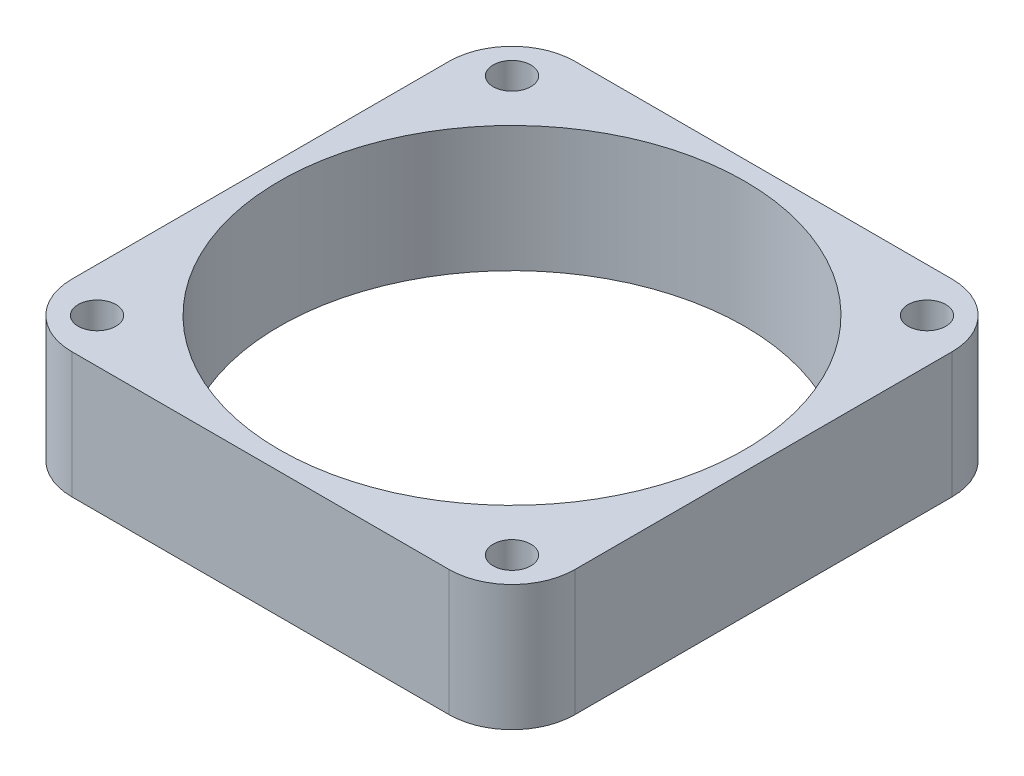
ISO-10303-21;
HEADER;
FILE_DESCRIPTION(('STEP AP214'),'2;1');
FILE_NAME('part.step','',(''),(''),'','','');
FILE_SCHEMA(('AUTOMOTIVE_DESIGN { 1 0 10303 214 1 1 1 1 }'));
ENDSEC;
DATA;
#1=APPLICATION_CONTEXT('core data for automotive mechanical design processes');
#2=APPLICATION_PROTOCOL_DEFINITION('international standard','automotive_design',2000,#1);
#3=PRODUCT_CONTEXT('',#1,'mechanical');
#4=PRODUCT('Part','Part','',(#3));
#5=PRODUCT_RELATED_PRODUCT_CATEGORY('part','',(#4));
#6=PRODUCT_DEFINITION_FORMATION('','',#4);
#7=PRODUCT_DEFINITION_CONTEXT('part definition',#1,'design');
#8=PRODUCT_DEFINITION('design','',#6,#7);
#9=PRODUCT_DEFINITION_SHAPE('','',#8);
#10=(LENGTH_UNIT() NAMED_UNIT(*) SI_UNIT(.MILLI.,.METRE.));
#11=(NAMED_UNIT(*) PLANE_ANGLE_UNIT() SI_UNIT($,.RADIAN.));
#12=(NAMED_UNIT(*) SI_UNIT($,.STERADIAN.) SOLID_ANGLE_UNIT());
#13=UNCERTAINTY_MEASURE_WITH_UNIT(LENGTH_MEASURE(1.E-05),#10,'distance_accuracy_value','');
#14=(GEOMETRIC_REPRESENTATION_CONTEXT(3) GLOBAL_UNCERTAINTY_ASSIGNED_CONTEXT((#13)) GLOBAL_UNIT_ASSIGNED_CONTEXT((#10,
#11,#12)) REPRESENTATION_CONTEXT('',''));
#15=CARTESIAN_POINT('',(0.,0.,0.));
#16=DIRECTION('',(0.,0.,1.));
#17=DIRECTION('',(1.,0.,0.));
#18=AXIS2_PLACEMENT_3D('',#15,#16,#17);
#19=CARTESIAN_POINT('',(20.,10.,20.));
#20=DIRECTION('',(-1.,0.,0.));
#21=DIRECTION('',(0.,0.,1.));
#22=AXIS2_PLACEMENT_3D('',#19,#20,#21);
#23=PLANE('',#22);
#24=DIRECTION('',(0.,0.,-1.));
#25=VECTOR('',#24,1.);
#26=CARTESIAN_POINT('',(20.,0.,20.));
#27=LINE('',#26,#25);
#28=CARTESIAN_POINT('',(20.,0.,15.));
#29=VERTEX_POINT('',#28);
#30=CARTESIAN_POINT('',(20.,0.,-15.));
#31=VERTEX_POINT('',#30);
#32=EDGE_CURVE('E130',#29,#31,#27,.T.);
#33=ORIENTED_EDGE('',*,*,#32,.T.);
#34=DIRECTION('',(0.,-1.,0.));
#35=VECTOR('',#34,1.);
#36=CARTESIAN_POINT('',(20.,10.,-15.));
#37=LINE('',#36,#35);
#38=CARTESIAN_POINT('',(20.,10.,-15.));
#39=VERTEX_POINT('',#38);
#40=EDGE_CURVE('E152',#31,#39,#37,.F.);
#41=ORIENTED_EDGE('',*,*,#40,.T.);
#42=DIRECTION('',(0.,0.,-1.));
#43=VECTOR('',#42,1.);
#44=CARTESIAN_POINT('',(20.,10.,20.));
#45=LINE('',#44,#43);
#46=CARTESIAN_POINT('',(20.,10.,15.));
#47=VERTEX_POINT('',#46);
#48=EDGE_CURVE('E128',#47,#39,#45,.T.);
#49=ORIENTED_EDGE('',*,*,#48,.F.);
#50=DIRECTION('',(0.,-1.,0.));
#51=VECTOR('',#50,1.);
#52=CARTESIAN_POINT('',(20.,10.,15.));
#53=LINE('',#52,#51);
#54=EDGE_CURVE('E149',#47,#29,#53,.T.);
#55=ORIENTED_EDGE('',*,*,#54,.T.);
#56=EDGE_LOOP('',(#33,#41,#49,#55));
#57=FACE_BOUND('',#56,.T.);
#58=ADVANCED_FACE('F33',(#57),#23,.F.);
#59=CARTESIAN_POINT('',(-20.,10.,-20.));
#60=DIRECTION('',(0.,0.,1.));
#61=DIRECTION('',(1.,0.,0.));
#62=AXIS2_PLACEMENT_3D('',#59,#60,#61);
#63=PLANE('',#62);
#64=DIRECTION('',(-1.,0.,0.));
#65=VECTOR('',#64,1.);
#66=CARTESIAN_POINT('',(-20.,0.,-20.));
#67=LINE('',#66,#65);
#68=CARTESIAN_POINT('',(15.,0.,-20.));
#69=VERTEX_POINT('',#68);
#70=CARTESIAN_POINT('',(-15.,0.,-20.));
#71=VERTEX_POINT('',#70);
#72=EDGE_CURVE('E126',#69,#71,#67,.T.);
#73=ORIENTED_EDGE('',*,*,#72,.T.);
#74=DIRECTION('',(0.,-1.,0.));
#75=VECTOR('',#74,1.);
#76=CARTESIAN_POINT('',(-15.,10.,-20.));
#77=LINE('',#76,#75);
#78=CARTESIAN_POINT('',(-15.,10.,-20.));
#79=VERTEX_POINT('',#78);
#80=EDGE_CURVE('E104',#71,#79,#77,.F.);
#81=ORIENTED_EDGE('',*,*,#80,.T.);
#82=DIRECTION('',(-1.,0.,0.));
#83=VECTOR('',#82,1.);
#84=CARTESIAN_POINT('',(-20.,10.,-20.));
#85=LINE('',#84,#83);
#86=CARTESIAN_POINT('',(15.,10.,-20.));
#87=VERTEX_POINT('',#86);
#88=EDGE_CURVE('E166',#87,#79,#85,.T.);
#89=ORIENTED_EDGE('',*,*,#88,.F.);
#90=DIRECTION('',(0.,-1.,0.));
#91=VECTOR('',#90,1.);
#92=CARTESIAN_POINT('',(15.,10.,-20.));
#93=LINE('',#92,#91);
#94=EDGE_CURVE('E109',#87,#69,#93,.T.);
#95=ORIENTED_EDGE('',*,*,#94,.T.);
#96=EDGE_LOOP('',(#73,#81,#89,#95));
#97=FACE_BOUND('',#96,.T.);
#98=ADVANCED_FACE('F171',(#97),#63,.F.);
#99=CARTESIAN_POINT('',(-20.,10.,20.));
#100=DIRECTION('',(1.,0.,0.));
#101=DIRECTION('',(0.,0.,-1.));
#102=AXIS2_PLACEMENT_3D('',#99,#100,#101);
#103=PLANE('',#102);
#104=DIRECTION('',(0.,0.,1.));
#105=VECTOR('',#104,1.);
#106=CARTESIAN_POINT('',(-20.,10.,20.));
#107=LINE('',#106,#105);
#108=CARTESIAN_POINT('',(-20.,10.,-15.));
#109=VERTEX_POINT('',#108);
#110=CARTESIAN_POINT('',(-20.,10.,15.));
#111=VERTEX_POINT('',#110);
#112=EDGE_CURVE('E118',#109,#111,#107,.T.);
#113=ORIENTED_EDGE('',*,*,#112,.F.);
#114=DIRECTION('',(0.,-1.,0.));
#115=VECTOR('',#114,1.);
#116=CARTESIAN_POINT('',(-20.,10.,-15.));
#117=LINE('',#116,#115);
#118=CARTESIAN_POINT('',(-20.,0.,-15.));
#119=VERTEX_POINT('',#118);
#120=EDGE_CURVE('E103',#109,#119,#117,.T.);
#121=ORIENTED_EDGE('',*,*,#120,.T.);
#122=DIRECTION('',(0.,0.,1.));
#123=VECTOR('',#122,1.);
#124=CARTESIAN_POINT('',(-20.,0.,20.));
#125=LINE('',#124,#123);
#126=CARTESIAN_POINT('',(-20.,0.,15.));
#127=VERTEX_POINT('',#126);
#128=EDGE_CURVE('E116',#119,#127,#125,.T.);
#129=ORIENTED_EDGE('',*,*,#128,.T.);
#130=DIRECTION('',(0.,-1.,0.));
#131=VECTOR('',#130,1.);
#132=CARTESIAN_POINT('',(-20.,10.,15.));
#133=LINE('',#132,#131);
#134=EDGE_CURVE('E120',#127,#111,#133,.F.);
#135=ORIENTED_EDGE('',*,*,#134,.T.);
#136=EDGE_LOOP('',(#113,#121,#129,#135));
#137=FACE_BOUND('',#136,.T.);
#138=ADVANCED_FACE('F115',(#137),#103,.F.);
#139=CARTESIAN_POINT('',(-20.,10.,20.));
#140=DIRECTION('',(0.,0.,-1.));
#141=DIRECTION('',(-1.,0.,0.));
#142=AXIS2_PLACEMENT_3D('',#139,#140,#141);
#143=PLANE('',#142);
#144=DIRECTION('',(1.,0.,0.));
#145=VECTOR('',#144,1.);
#146=CARTESIAN_POINT('',(-20.,10.,20.));
#147=LINE('',#146,#145);
#148=CARTESIAN_POINT('',(-15.,10.,20.));
#149=VERTEX_POINT('',#148);
#150=CARTESIAN_POINT('',(15.,10.,20.));
#151=VERTEX_POINT('',#150);
#152=EDGE_CURVE('E134',#149,#151,#147,.T.);
#153=ORIENTED_EDGE('',*,*,#152,.F.);
#154=DIRECTION('',(0.,-1.,0.));
#155=VECTOR('',#154,1.);
#156=CARTESIAN_POINT('',(-15.,10.,20.));
#157=LINE('',#156,#155);
#158=CARTESIAN_POINT('',(-15.,0.,20.));
#159=VERTEX_POINT('',#158);
#160=EDGE_CURVE('E11',#149,#159,#157,.T.);
#161=ORIENTED_EDGE('',*,*,#160,.T.);
#162=DIRECTION('',(1.,0.,0.));
#163=VECTOR('',#162,1.);
#164=CARTESIAN_POINT('',(-20.,0.,20.));
#165=LINE('',#164,#163);
#166=CARTESIAN_POINT('',(15.,0.,20.));
#167=VERTEX_POINT('',#166);
#168=EDGE_CURVE('E125',#159,#167,#165,.T.);
#169=ORIENTED_EDGE('',*,*,#168,.T.);
#170=DIRECTION('',(0.,-1.,0.));
#171=VECTOR('',#170,1.);
#172=CARTESIAN_POINT('',(15.,10.,20.));
#173=LINE('',#172,#171);
#174=EDGE_CURVE('E41',#167,#151,#173,.F.);
#175=ORIENTED_EDGE('',*,*,#174,.T.);
#176=EDGE_LOOP('',(#153,#161,#169,#175));
#177=FACE_BOUND('',#176,.T.);
#178=ADVANCED_FACE('F218',(#177),#143,.F.);
#179=CARTESIAN_POINT('',(20.,10.,-20.));
#180=DIRECTION('',(0.,-1.,0.));
#181=DIRECTION('',(0.,0.,-1.));
#182=AXIS2_PLACEMENT_3D('',#179,#180,#181);
#183=PLANE('',#182);
#184=CARTESIAN_POINT('',(-16.5,10.,16.5));
#185=DIRECTION('',(0.,1.,0.));
#186=DIRECTION('',(0.,0.,-1.));
#187=AXIS2_PLACEMENT_3D('',#184,#185,#186);
#188=CIRCLE('',#187,1.5);
#189=CARTESIAN_POINT('',(-16.5,10.,15.));
#190=VERTEX_POINT('',#189);
#191=EDGE_CURVE('E201',#190,#190,#188,.T.);
#192=ORIENTED_EDGE('',*,*,#191,.F.);
#193=EDGE_LOOP('',(#192));
#194=FACE_BOUND('',#193,.T.);
#195=CARTESIAN_POINT('',(16.5,10.,16.5));
#196=DIRECTION('',(0.,1.,0.));
#197=DIRECTION('',(0.,0.,1.));
#198=AXIS2_PLACEMENT_3D('',#195,#196,#197);
#199=CIRCLE('',#198,1.5);
#200=CARTESIAN_POINT('',(16.5,10.,18.));
#201=VERTEX_POINT('',#200);
#202=EDGE_CURVE('E195',#201,#201,#199,.T.);
#203=ORIENTED_EDGE('',*,*,#202,.F.);
#204=EDGE_LOOP('',(#203));
#205=FACE_BOUND('',#204,.T.);
#206=CARTESIAN_POINT('',(16.5,10.,-16.5));
#207=DIRECTION('',(0.,1.,0.));
#208=DIRECTION('',(0.,0.,-1.));
#209=AXIS2_PLACEMENT_3D('',#206,#207,#208);
#210=CIRCLE('',#209,1.5);
#211=CARTESIAN_POINT('',(16.5,10.,-18.));
#212=VERTEX_POINT('',#211);
#213=EDGE_CURVE('E189',#212,#212,#210,.T.);
#214=ORIENTED_EDGE('',*,*,#213,.F.);
#215=EDGE_LOOP('',(#214));
#216=FACE_BOUND('',#215,.T.);
#217=CARTESIAN_POINT('',(-16.5,10.,-16.5));
#218=DIRECTION('',(0.,1.,0.));
#219=DIRECTION('',(0.,0.,1.));
#220=AXIS2_PLACEMENT_3D('',#217,#218,#219);
#221=CIRCLE('',#220,1.5);
#222=CARTESIAN_POINT('',(-16.5,10.,-15.));
#223=VERTEX_POINT('',#222);
#224=EDGE_CURVE('E183',#223,#223,#221,.T.);
#225=ORIENTED_EDGE('',*,*,#224,.F.);
#226=EDGE_LOOP('',(#225));
#227=FACE_BOUND('',#226,.T.);
#228=CARTESIAN_POINT('',(0.,10.,0.));
#229=DIRECTION('',(0.,1.,0.));
#230=DIRECTION('',(0.,0.,1.));
#231=AXIS2_PLACEMENT_3D('',#228,#229,#230);
#232=CIRCLE('',#231,18.5);
#233=CARTESIAN_POINT('',(0.,10.,18.5));
#234=VERTEX_POINT('',#233);
#235=EDGE_CURVE('E174',#234,#234,#232,.T.);
#236=ORIENTED_EDGE('',*,*,#235,.F.);
#237=EDGE_LOOP('',(#236));
#238=FACE_BOUND('',#237,.T.);
#239=ORIENTED_EDGE('',*,*,#88,.T.);
#240=CARTESIAN_POINT('',(-15.,10.,-15.));
#241=DIRECTION('',(0.,-1.,0.));
#242=DIRECTION('',(0.,0.,-1.));
#243=AXIS2_PLACEMENT_3D('',#240,#241,#242);
#244=CIRCLE('',#243,5.);
#245=EDGE_CURVE('E147',#79,#109,#244,.F.);
#246=ORIENTED_EDGE('',*,*,#245,.T.);
#247=ORIENTED_EDGE('',*,*,#112,.T.);
#248=CARTESIAN_POINT('',(-15.,10.,15.));
#249=DIRECTION('',(0.,-1.,0.));
#250=DIRECTION('',(0.,0.,-1.));
#251=AXIS2_PLACEMENT_3D('',#248,#249,#250);
#252=CIRCLE('',#251,5.);
#253=EDGE_CURVE('E54',#111,#149,#252,.F.);
#254=ORIENTED_EDGE('',*,*,#253,.T.);
#255=ORIENTED_EDGE('',*,*,#152,.T.);
#256=CARTESIAN_POINT('',(15.,10.,15.));
#257=DIRECTION('',(0.,-1.,0.));
#258=DIRECTION('',(0.,0.,-1.));
#259=AXIS2_PLACEMENT_3D('',#256,#257,#258);
#260=CIRCLE('',#259,5.);
#261=EDGE_CURVE('E142',#151,#47,#260,.F.);
#262=ORIENTED_EDGE('',*,*,#261,.T.);
#263=ORIENTED_EDGE('',*,*,#48,.T.);
#264=CARTESIAN_POINT('',(15.,10.,-15.));
#265=DIRECTION('',(0.,-1.,0.));
#266=DIRECTION('',(0.,0.,-1.));
#267=AXIS2_PLACEMENT_3D('',#264,#265,#266);
#268=CIRCLE('',#267,5.);
#269=EDGE_CURVE('E145',#39,#87,#268,.F.);
#270=ORIENTED_EDGE('',*,*,#269,.T.);
#271=EDGE_LOOP('',(#239,#246,#247,#254,#255,#262,#263,#270));
#272=FACE_BOUND('',#271,.T.);
#273=ADVANCED_FACE('F163',(#194,#205,#216,#227,#238,#272),#183,.F.);
#274=CARTESIAN_POINT('',(20.,0.,-20.));
#275=DIRECTION('',(0.,-1.,0.));
#276=DIRECTION('',(0.,0.,-1.));
#277=AXIS2_PLACEMENT_3D('',#274,#275,#276);
#278=PLANE('',#277);
#279=CARTESIAN_POINT('',(-16.5,0.,16.5));
#280=DIRECTION('',(0.,1.,0.));
#281=DIRECTION('',(0.,0.,-1.));
#282=AXIS2_PLACEMENT_3D('',#279,#280,#281);
#283=CIRCLE('',#282,1.5);
#284=CARTESIAN_POINT('',(-16.5,0.,15.));
#285=VERTEX_POINT('',#284);
#286=EDGE_CURVE('E198',#285,#285,#283,.T.);
#287=ORIENTED_EDGE('',*,*,#286,.T.);
#288=EDGE_LOOP('',(#287));
#289=FACE_BOUND('',#288,.T.);
#290=CARTESIAN_POINT('',(16.5,0.,16.5));
#291=DIRECTION('',(0.,1.,0.));
#292=DIRECTION('',(0.,0.,1.));
#293=AXIS2_PLACEMENT_3D('',#290,#291,#292);
#294=CIRCLE('',#293,1.5);
#295=CARTESIAN_POINT('',(16.5,0.,18.));
#296=VERTEX_POINT('',#295);
#297=EDGE_CURVE('E192',#296,#296,#294,.T.);
#298=ORIENTED_EDGE('',*,*,#297,.T.);
#299=EDGE_LOOP('',(#298));
#300=FACE_BOUND('',#299,.T.);
#301=CARTESIAN_POINT('',(16.5,0.,-16.5));
#302=DIRECTION('',(0.,1.,0.));
#303=DIRECTION('',(0.,0.,-1.));
#304=AXIS2_PLACEMENT_3D('',#301,#302,#303);
#305=CIRCLE('',#304,1.5);
#306=CARTESIAN_POINT('',(16.5,0.,-18.));
#307=VERTEX_POINT('',#306);
#308=EDGE_CURVE('E186',#307,#307,#305,.T.);
#309=ORIENTED_EDGE('',*,*,#308,.T.);
#310=EDGE_LOOP('',(#309));
#311=FACE_BOUND('',#310,.T.);
#312=CARTESIAN_POINT('',(-16.5,0.,-16.5));
#313=DIRECTION('',(0.,1.,0.));
#314=DIRECTION('',(0.,0.,1.));
#315=AXIS2_PLACEMENT_3D('',#312,#313,#314);
#316=CIRCLE('',#315,1.5);
#317=CARTESIAN_POINT('',(-16.5,0.,-15.));
#318=VERTEX_POINT('',#317);
#319=EDGE_CURVE('E181',#318,#318,#316,.T.);
#320=ORIENTED_EDGE('',*,*,#319,.T.);
#321=EDGE_LOOP('',(#320));
#322=FACE_BOUND('',#321,.T.);
#323=CARTESIAN_POINT('',(0.,0.,0.));
#324=DIRECTION('',(0.,1.,0.));
#325=DIRECTION('',(0.,0.,1.));
#326=AXIS2_PLACEMENT_3D('',#323,#324,#325);
#327=CIRCLE('',#326,18.5);
#328=CARTESIAN_POINT('',(0.,0.,18.5));
#329=VERTEX_POINT('',#328);
#330=EDGE_CURVE('E172',#329,#329,#327,.T.);
#331=ORIENTED_EDGE('',*,*,#330,.T.);
#332=EDGE_LOOP('',(#331));
#333=FACE_BOUND('',#332,.T.);
#334=ORIENTED_EDGE('',*,*,#128,.F.);
#335=CARTESIAN_POINT('',(-15.,0.,-15.));
#336=DIRECTION('',(0.,-1.,0.));
#337=DIRECTION('',(0.,0.,-1.));
#338=AXIS2_PLACEMENT_3D('',#335,#336,#337);
#339=CIRCLE('',#338,5.);
#340=EDGE_CURVE('E99',#119,#71,#339,.T.);
#341=ORIENTED_EDGE('',*,*,#340,.T.);
#342=ORIENTED_EDGE('',*,*,#72,.F.);
#343=CARTESIAN_POINT('',(15.,0.,-15.));
#344=DIRECTION('',(0.,-1.,0.));
#345=DIRECTION('',(0.,0.,-1.));
#346=AXIS2_PLACEMENT_3D('',#343,#344,#345);
#347=CIRCLE('',#346,5.);
#348=EDGE_CURVE('E110',#69,#31,#347,.T.);
#349=ORIENTED_EDGE('',*,*,#348,.T.);
#350=ORIENTED_EDGE('',*,*,#32,.F.);
#351=CARTESIAN_POINT('',(15.,0.,15.));
#352=DIRECTION('',(0.,-1.,0.));
#353=DIRECTION('',(0.,0.,-1.));
#354=AXIS2_PLACEMENT_3D('',#351,#352,#353);
#355=CIRCLE('',#354,5.);
#356=EDGE_CURVE('E119',#29,#167,#355,.T.);
#357=ORIENTED_EDGE('',*,*,#356,.T.);
#358=ORIENTED_EDGE('',*,*,#168,.F.);
#359=CARTESIAN_POINT('',(-15.,0.,15.));
#360=DIRECTION('',(0.,-1.,0.));
#361=DIRECTION('',(0.,0.,-1.));
#362=AXIS2_PLACEMENT_3D('',#359,#360,#361);
#363=CIRCLE('',#362,5.);
#364=EDGE_CURVE('E124',#159,#127,#363,.T.);
#365=ORIENTED_EDGE('',*,*,#364,.T.);
#366=EDGE_LOOP('',(#334,#341,#342,#349,#350,#357,#358,#365));
#367=FACE_BOUND('',#366,.T.);
#368=ADVANCED_FACE('F122',(#289,#300,#311,#322,#333,#367),#278,.T.);
#369=CARTESIAN_POINT('',(-15.,10.,-15.));
#370=DIRECTION('',(0.,-1.,0.));
#371=DIRECTION('',(0.,0.,-1.));
#372=AXIS2_PLACEMENT_3D('',#369,#370,#371);
#373=CYLINDRICAL_SURFACE('',#372,5.);
#374=ORIENTED_EDGE('',*,*,#245,.F.);
#375=ORIENTED_EDGE('',*,*,#80,.F.);
#376=ORIENTED_EDGE('',*,*,#340,.F.);
#377=ORIENTED_EDGE('',*,*,#120,.F.);
#378=EDGE_LOOP('',(#374,#375,#376,#377));
#379=FACE_BOUND('',#378,.T.);
#380=ADVANCED_FACE('F102',(#379),#373,.T.);
#381=CARTESIAN_POINT('',(15.,10.,-15.));
#382=DIRECTION('',(0.,-1.,0.));
#383=DIRECTION('',(0.,0.,-1.));
#384=AXIS2_PLACEMENT_3D('',#381,#382,#383);
#385=CYLINDRICAL_SURFACE('',#384,5.);
#386=ORIENTED_EDGE('',*,*,#269,.F.);
#387=ORIENTED_EDGE('',*,*,#40,.F.);
#388=ORIENTED_EDGE('',*,*,#348,.F.);
#389=ORIENTED_EDGE('',*,*,#94,.F.);
#390=EDGE_LOOP('',(#386,#387,#388,#389));
#391=FACE_BOUND('',#390,.T.);
#392=ADVANCED_FACE('F169',(#391),#385,.T.);
#393=CARTESIAN_POINT('',(-15.,10.,15.));
#394=DIRECTION('',(0.,-1.,0.));
#395=DIRECTION('',(0.,0.,-1.));
#396=AXIS2_PLACEMENT_3D('',#393,#394,#395);
#397=CYLINDRICAL_SURFACE('',#396,5.);
#398=ORIENTED_EDGE('',*,*,#253,.F.);
#399=ORIENTED_EDGE('',*,*,#134,.F.);
#400=ORIENTED_EDGE('',*,*,#364,.F.);
#401=ORIENTED_EDGE('',*,*,#160,.F.);
#402=EDGE_LOOP('',(#398,#399,#400,#401));
#403=FACE_BOUND('',#402,.T.);
#404=ADVANCED_FACE('F240',(#403),#397,.T.);
#405=CARTESIAN_POINT('',(15.,10.,15.));
#406=DIRECTION('',(0.,-1.,0.));
#407=DIRECTION('',(0.,0.,-1.));
#408=AXIS2_PLACEMENT_3D('',#405,#406,#407);
#409=CYLINDRICAL_SURFACE('',#408,5.);
#410=ORIENTED_EDGE('',*,*,#261,.F.);
#411=ORIENTED_EDGE('',*,*,#174,.F.);
#412=ORIENTED_EDGE('',*,*,#356,.F.);
#413=ORIENTED_EDGE('',*,*,#54,.F.);
#414=EDGE_LOOP('',(#410,#411,#412,#413));
#415=FACE_BOUND('',#414,.T.);
#416=ADVANCED_FACE('F35',(#415),#409,.T.);
#417=CARTESIAN_POINT('',(0.,0.,0.));
#418=DIRECTION('',(0.,1.,0.));
#419=DIRECTION('',(0.,0.,1.));
#420=AXIS2_PLACEMENT_3D('',#417,#418,#419);
#421=CYLINDRICAL_SURFACE('',#420,18.5);
#422=ORIENTED_EDGE('',*,*,#330,.F.);
#423=EDGE_LOOP('',(#422));
#424=FACE_BOUND('',#423,.T.);
#425=ORIENTED_EDGE('',*,*,#235,.T.);
#426=EDGE_LOOP('',(#425));
#427=FACE_BOUND('',#426,.T.);
#428=ADVANCED_FACE('F228',(#424,#427),#421,.F.);
#429=CARTESIAN_POINT('',(-16.5,0.,-16.5));
#430=DIRECTION('',(0.,1.,0.));
#431=DIRECTION('',(0.,0.,1.));
#432=AXIS2_PLACEMENT_3D('',#429,#430,#431);
#433=CYLINDRICAL_SURFACE('',#432,1.5);
#434=ORIENTED_EDGE('',*,*,#319,.F.);
#435=EDGE_LOOP('',(#434));
#436=FACE_BOUND('',#435,.T.);
#437=ORIENTED_EDGE('',*,*,#224,.T.);
#438=EDGE_LOOP('',(#437));
#439=FACE_BOUND('',#438,.T.);
#440=ADVANCED_FACE('F230',(#436,#439),#433,.F.);
#441=CARTESIAN_POINT('',(16.5,0.,-16.5));
#442=DIRECTION('',(0.,1.,0.));
#443=DIRECTION('',(0.,0.,1.));
#444=AXIS2_PLACEMENT_3D('',#441,#442,#443);
#445=CYLINDRICAL_SURFACE('',#444,1.5);
#446=ORIENTED_EDGE('',*,*,#308,.F.);
#447=EDGE_LOOP('',(#446));
#448=FACE_BOUND('',#447,.T.);
#449=ORIENTED_EDGE('',*,*,#213,.T.);
#450=EDGE_LOOP('',(#449));
#451=FACE_BOUND('',#450,.T.);
#452=ADVANCED_FACE('F237',(#448,#451),#445,.F.);
#453=CARTESIAN_POINT('',(16.5,0.,16.5));
#454=DIRECTION('',(0.,1.,0.));
#455=DIRECTION('',(0.,0.,1.));
#456=AXIS2_PLACEMENT_3D('',#453,#454,#455);
#457=CYLINDRICAL_SURFACE('',#456,1.5);
#458=ORIENTED_EDGE('',*,*,#297,.F.);
#459=EDGE_LOOP('',(#458));
#460=FACE_BOUND('',#459,.T.);
#461=ORIENTED_EDGE('',*,*,#202,.T.);
#462=EDGE_LOOP('',(#461));
#463=FACE_BOUND('',#462,.T.);
#464=ADVANCED_FACE('F212',(#460,#463),#457,.F.);
#465=CARTESIAN_POINT('',(-16.5,0.,16.5));
#466=DIRECTION('',(0.,1.,0.));
#467=DIRECTION('',(0.,0.,1.));
#468=AXIS2_PLACEMENT_3D('',#465,#466,#467);
#469=CYLINDRICAL_SURFACE('',#468,1.5);
#470=ORIENTED_EDGE('',*,*,#286,.F.);
#471=EDGE_LOOP('',(#470));
#472=FACE_BOUND('',#471,.T.);
#473=ORIENTED_EDGE('',*,*,#191,.T.);
#474=EDGE_LOOP('',(#473));
#475=FACE_BOUND('',#474,.T.);
#476=ADVANCED_FACE('F209',(#472,#475),#469,.F.);
#477=CLOSED_SHELL('',(#58,#98,#138,#178,#273,#368,#380,#392,#404,#416,#428,#440,#452,#464,#476));
#478=MANIFOLD_SOLID_BREP('B2',#477);
#479=ADVANCED_BREP_SHAPE_REPRESENTATION('',(#18,#478),#14);
#480=SHAPE_DEFINITION_REPRESENTATION(#9,#479);
ENDSEC;
END-ISO-10303-21;
